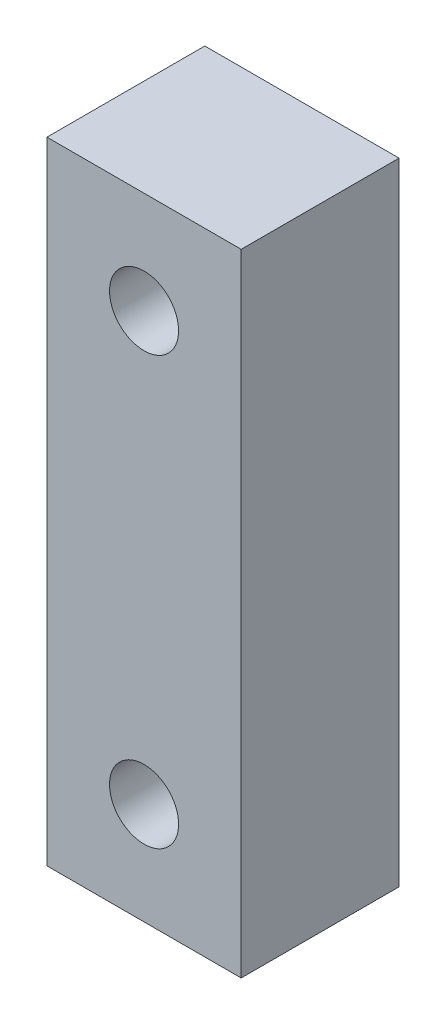
ISO-10303-21;
HEADER;
FILE_DESCRIPTION(('STEP AP214'),'2;1');
FILE_NAME('part.step','',(''),(''),'','','');
FILE_SCHEMA(('AUTOMOTIVE_DESIGN { 1 0 10303 214 1 1 1 1 }'));
ENDSEC;
DATA;
#1=APPLICATION_CONTEXT('core data for automotive mechanical design processes');
#2=APPLICATION_PROTOCOL_DEFINITION('international standard','automotive_design',2000,#1);
#3=PRODUCT_CONTEXT('',#1,'mechanical');
#4=PRODUCT('Part','Part','',(#3));
#5=PRODUCT_RELATED_PRODUCT_CATEGORY('part','',(#4));
#6=PRODUCT_DEFINITION_FORMATION('','',#4);
#7=PRODUCT_DEFINITION_CONTEXT('part definition',#1,'design');
#8=PRODUCT_DEFINITION('design','',#6,#7);
#9=PRODUCT_DEFINITION_SHAPE('','',#8);
#10=(LENGTH_UNIT() NAMED_UNIT(*) SI_UNIT(.MILLI.,.METRE.));
#11=(NAMED_UNIT(*) PLANE_ANGLE_UNIT() SI_UNIT($,.RADIAN.));
#12=(NAMED_UNIT(*) SI_UNIT($,.STERADIAN.) SOLID_ANGLE_UNIT());
#13=UNCERTAINTY_MEASURE_WITH_UNIT(LENGTH_MEASURE(1.E-05),#10,'distance_accuracy_value','');
#14=(GEOMETRIC_REPRESENTATION_CONTEXT(3) GLOBAL_UNCERTAINTY_ASSIGNED_CONTEXT((#13)) GLOBAL_UNIT_ASSIGNED_CONTEXT((#10,
#11,#12)) REPRESENTATION_CONTEXT('',''));
#15=CARTESIAN_POINT('',(0.,0.,0.));
#16=DIRECTION('',(0.,0.,1.));
#17=DIRECTION('',(1.,0.,0.));
#18=AXIS2_PLACEMENT_3D('',#15,#16,#17);
#19=CARTESIAN_POINT('',(5.,16.245,0.));
#20=DIRECTION('',(0.,1.,0.));
#21=DIRECTION('',(0.,0.,1.));
#22=AXIS2_PLACEMENT_3D('',#19,#20,#21);
#23=PLANE('',#22);
#24=DIRECTION('',(-1.,0.,0.));
#25=VECTOR('',#24,1.);
#26=CARTESIAN_POINT('',(5.,16.245,4.064));
#27=LINE('',#26,#25);
#28=CARTESIAN_POINT('',(5.,16.245,4.064));
#29=VERTEX_POINT('',#28);
#30=CARTESIAN_POINT('',(0.,16.245,4.064));
#31=VERTEX_POINT('',#30);
#32=EDGE_CURVE('E98',#29,#31,#27,.T.);
#33=ORIENTED_EDGE('',*,*,#32,.F.);
#34=DIRECTION('',(0.,0.,1.));
#35=VECTOR('',#34,1.);
#36=CARTESIAN_POINT('',(5.,16.245,0.));
#37=LINE('',#36,#35);
#38=CARTESIAN_POINT('',(5.,16.245,0.));
#39=VERTEX_POINT('',#38);
#40=EDGE_CURVE('E11',#39,#29,#37,.T.);
#41=ORIENTED_EDGE('',*,*,#40,.F.);
#42=DIRECTION('',(-1.,0.,0.));
#43=VECTOR('',#42,1.);
#44=CARTESIAN_POINT('',(5.,16.245,0.));
#45=LINE('',#44,#43);
#46=CARTESIAN_POINT('',(0.,16.245,0.));
#47=VERTEX_POINT('',#46);
#48=EDGE_CURVE('E91',#39,#47,#45,.T.);
#49=ORIENTED_EDGE('',*,*,#48,.T.);
#50=DIRECTION('',(0.,0.,1.));
#51=VECTOR('',#50,1.);
#52=CARTESIAN_POINT('',(0.,16.245,0.));
#53=LINE('',#52,#51);
#54=EDGE_CURVE('E36',#47,#31,#53,.T.);
#55=ORIENTED_EDGE('',*,*,#54,.T.);
#56=EDGE_LOOP('',(#33,#41,#49,#55));
#57=FACE_BOUND('',#56,.T.);
#58=ADVANCED_FACE('F33',(#57),#23,.T.);
#59=CARTESIAN_POINT('',(5.,0.,0.));
#60=DIRECTION('',(1.,0.,0.));
#61=DIRECTION('',(0.,0.,-1.));
#62=AXIS2_PLACEMENT_3D('',#59,#60,#61);
#63=PLANE('',#62);
#64=DIRECTION('',(0.,1.,0.));
#65=VECTOR('',#64,1.);
#66=CARTESIAN_POINT('',(5.,0.,4.064));
#67=LINE('',#66,#65);
#68=CARTESIAN_POINT('',(5.,0.,4.064));
#69=VERTEX_POINT('',#68);
#70=EDGE_CURVE('E93',#69,#29,#67,.T.);
#71=ORIENTED_EDGE('',*,*,#70,.F.);
#72=DIRECTION('',(0.,0.,1.));
#73=VECTOR('',#72,1.);
#74=CARTESIAN_POINT('',(5.,0.,0.));
#75=LINE('',#74,#73);
#76=CARTESIAN_POINT('',(5.,0.,0.));
#77=VERTEX_POINT('',#76);
#78=EDGE_CURVE('E42',#77,#69,#75,.T.);
#79=ORIENTED_EDGE('',*,*,#78,.F.);
#80=DIRECTION('',(0.,1.,0.));
#81=VECTOR('',#80,1.);
#82=CARTESIAN_POINT('',(5.,0.,0.));
#83=LINE('',#82,#81);
#84=EDGE_CURVE('E88',#77,#39,#83,.T.);
#85=ORIENTED_EDGE('',*,*,#84,.T.);
#86=ORIENTED_EDGE('',*,*,#40,.T.);
#87=EDGE_LOOP('',(#71,#79,#85,#86));
#88=FACE_BOUND('',#87,.T.);
#89=ADVANCED_FACE('F109',(#88),#63,.T.);
#90=CARTESIAN_POINT('',(0.,0.,0.));
#91=DIRECTION('',(0.,-1.,0.));
#92=DIRECTION('',(0.,0.,-1.));
#93=AXIS2_PLACEMENT_3D('',#90,#91,#92);
#94=PLANE('',#93);
#95=DIRECTION('',(1.,0.,0.));
#96=VECTOR('',#95,1.);
#97=CARTESIAN_POINT('',(0.,0.,4.064));
#98=LINE('',#97,#96);
#99=CARTESIAN_POINT('',(0.,0.,4.064));
#100=VERTEX_POINT('',#99);
#101=EDGE_CURVE('E83',#100,#69,#98,.T.);
#102=ORIENTED_EDGE('',*,*,#101,.F.);
#103=DIRECTION('',(0.,0.,1.));
#104=VECTOR('',#103,1.);
#105=CARTESIAN_POINT('',(0.,0.,0.));
#106=LINE('',#105,#104);
#107=CARTESIAN_POINT('',(0.,0.,0.));
#108=VERTEX_POINT('',#107);
#109=EDGE_CURVE('E78',#108,#100,#106,.T.);
#110=ORIENTED_EDGE('',*,*,#109,.F.);
#111=DIRECTION('',(1.,0.,0.));
#112=VECTOR('',#111,1.);
#113=CARTESIAN_POINT('',(0.,0.,0.));
#114=LINE('',#113,#112);
#115=EDGE_CURVE('E81',#108,#77,#114,.T.);
#116=ORIENTED_EDGE('',*,*,#115,.T.);
#117=ORIENTED_EDGE('',*,*,#78,.T.);
#118=EDGE_LOOP('',(#102,#110,#116,#117));
#119=FACE_BOUND('',#118,.T.);
#120=ADVANCED_FACE('F80',(#119),#94,.T.);
#121=CARTESIAN_POINT('',(0.,16.245,0.));
#122=DIRECTION('',(-1.,0.,0.));
#123=DIRECTION('',(0.,-1.,0.));
#124=AXIS2_PLACEMENT_3D('',#121,#122,#123);
#125=PLANE('',#124);
#126=DIRECTION('',(0.,-1.,0.));
#127=VECTOR('',#126,1.);
#128=CARTESIAN_POINT('',(0.,16.245,4.064));
#129=LINE('',#128,#127);
#130=EDGE_CURVE('E101',#31,#100,#129,.T.);
#131=ORIENTED_EDGE('',*,*,#130,.F.);
#132=ORIENTED_EDGE('',*,*,#54,.F.);
#133=DIRECTION('',(0.,-1.,0.));
#134=VECTOR('',#133,1.);
#135=CARTESIAN_POINT('',(0.,16.245,0.));
#136=LINE('',#135,#134);
#137=EDGE_CURVE('E87',#47,#108,#136,.T.);
#138=ORIENTED_EDGE('',*,*,#137,.T.);
#139=ORIENTED_EDGE('',*,*,#109,.T.);
#140=EDGE_LOOP('',(#131,#132,#138,#139));
#141=FACE_BOUND('',#140,.T.);
#142=ADVANCED_FACE('F90',(#141),#125,.T.);
#143=CARTESIAN_POINT('',(0.,0.,0.));
#144=DIRECTION('',(0.,0.,1.));
#145=DIRECTION('',(1.,0.,0.));
#146=AXIS2_PLACEMENT_3D('',#143,#144,#145);
#147=PLANE('',#146);
#148=CARTESIAN_POINT('',(2.5,13.6225,0.));
#149=DIRECTION('',(0.,0.,1.));
#150=DIRECTION('',(-1.,0.,0.));
#151=AXIS2_PLACEMENT_3D('',#148,#149,#150);
#152=CIRCLE('',#151,0.889);
#153=CARTESIAN_POINT('',(1.611,13.6225,0.));
#154=VERTEX_POINT('',#153);
#155=EDGE_CURVE('E142',#154,#154,#152,.T.);
#156=ORIENTED_EDGE('',*,*,#155,.T.);
#157=EDGE_LOOP('',(#156));
#158=FACE_BOUND('',#157,.T.);
#159=CARTESIAN_POINT('',(2.5,2.6225,0.));
#160=DIRECTION('',(0.,0.,1.));
#161=DIRECTION('',(-1.,0.,0.));
#162=AXIS2_PLACEMENT_3D('',#159,#160,#161);
#163=CIRCLE('',#162,0.889);
#164=CARTESIAN_POINT('',(1.611,2.6225,0.));
#165=VERTEX_POINT('',#164);
#166=EDGE_CURVE('E102',#165,#165,#163,.T.);
#167=ORIENTED_EDGE('',*,*,#166,.T.);
#168=EDGE_LOOP('',(#167));
#169=FACE_BOUND('',#168,.T.);
#170=ORIENTED_EDGE('',*,*,#48,.F.);
#171=ORIENTED_EDGE('',*,*,#84,.F.);
#172=ORIENTED_EDGE('',*,*,#115,.F.);
#173=ORIENTED_EDGE('',*,*,#137,.F.);
#174=EDGE_LOOP('',(#170,#171,#172,#173));
#175=FACE_BOUND('',#174,.T.);
#176=ADVANCED_FACE('F86',(#158,#169,#175),#147,.F.);
#177=CARTESIAN_POINT('',(0.,0.,4.064));
#178=DIRECTION('',(0.,0.,1.));
#179=DIRECTION('',(1.,0.,0.));
#180=AXIS2_PLACEMENT_3D('',#177,#178,#179);
#181=PLANE('',#180);
#182=CARTESIAN_POINT('',(2.5,13.6225,4.064));
#183=DIRECTION('',(0.,0.,1.));
#184=DIRECTION('',(-1.,0.,0.));
#185=AXIS2_PLACEMENT_3D('',#182,#183,#184);
#186=CIRCLE('',#185,0.889);
#187=CARTESIAN_POINT('',(1.611,13.6225,4.064));
#188=VERTEX_POINT('',#187);
#189=EDGE_CURVE('E145',#188,#188,#186,.T.);
#190=ORIENTED_EDGE('',*,*,#189,.F.);
#191=EDGE_LOOP('',(#190));
#192=FACE_BOUND('',#191,.T.);
#193=CARTESIAN_POINT('',(2.5,2.6225,4.064));
#194=DIRECTION('',(0.,0.,1.));
#195=DIRECTION('',(-1.,0.,0.));
#196=AXIS2_PLACEMENT_3D('',#193,#194,#195);
#197=CIRCLE('',#196,0.889);
#198=CARTESIAN_POINT('',(1.611,2.6225,4.064));
#199=VERTEX_POINT('',#198);
#200=EDGE_CURVE('E147',#199,#199,#197,.T.);
#201=ORIENTED_EDGE('',*,*,#200,.F.);
#202=EDGE_LOOP('',(#201));
#203=FACE_BOUND('',#202,.T.);
#204=ORIENTED_EDGE('',*,*,#32,.T.);
#205=ORIENTED_EDGE('',*,*,#130,.T.);
#206=ORIENTED_EDGE('',*,*,#101,.T.);
#207=ORIENTED_EDGE('',*,*,#70,.T.);
#208=EDGE_LOOP('',(#204,#205,#206,#207));
#209=FACE_BOUND('',#208,.T.);
#210=ADVANCED_FACE('F108',(#192,#203,#209),#181,.T.);
#211=CARTESIAN_POINT('',(2.5,2.6225,0.));
#212=DIRECTION('',(0.,0.,1.));
#213=DIRECTION('',(1.,0.,0.));
#214=AXIS2_PLACEMENT_3D('',#211,#212,#213);
#215=CYLINDRICAL_SURFACE('',#214,0.889);
#216=ORIENTED_EDGE('',*,*,#166,.F.);
#217=EDGE_LOOP('',(#216));
#218=FACE_BOUND('',#217,.T.);
#219=ORIENTED_EDGE('',*,*,#200,.T.);
#220=EDGE_LOOP('',(#219));
#221=FACE_BOUND('',#220,.T.);
#222=ADVANCED_FACE('F127',(#218,#221),#215,.F.);
#223=CARTESIAN_POINT('',(2.5,13.6225,0.));
#224=DIRECTION('',(0.,0.,1.));
#225=DIRECTION('',(1.,0.,0.));
#226=AXIS2_PLACEMENT_3D('',#223,#224,#225);
#227=CYLINDRICAL_SURFACE('',#226,0.889);
#228=ORIENTED_EDGE('',*,*,#155,.F.);
#229=EDGE_LOOP('',(#228));
#230=FACE_BOUND('',#229,.T.);
#231=ORIENTED_EDGE('',*,*,#189,.T.);
#232=EDGE_LOOP('',(#231));
#233=FACE_BOUND('',#232,.T.);
#234=ADVANCED_FACE('F134',(#230,#233),#227,.F.);
#235=CLOSED_SHELL('',(#58,#89,#120,#142,#176,#210,#222,#234));
#236=MANIFOLD_SOLID_BREP('B2',#235);
#237=ADVANCED_BREP_SHAPE_REPRESENTATION('',(#18,#236),#14);
#238=SHAPE_DEFINITION_REPRESENTATION(#9,#237);
ENDSEC;
END-ISO-10303-21;
